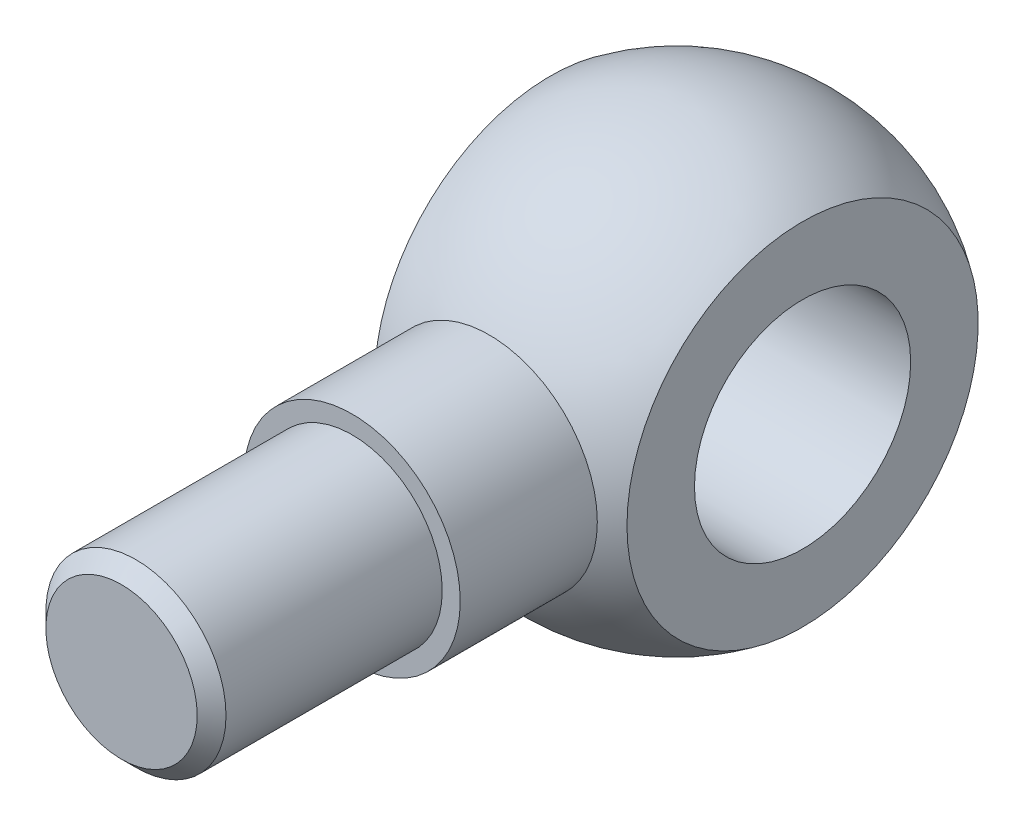
ISO-10303-21;
HEADER;
FILE_DESCRIPTION(('STEP AP214'),'2;1');
FILE_NAME('part.step','',(''),(''),'','','');
FILE_SCHEMA(('AUTOMOTIVE_DESIGN { 1 0 10303 214 1 1 1 1 }'));
ENDSEC;
DATA;
#1=APPLICATION_CONTEXT('core data for automotive mechanical design processes');
#2=APPLICATION_PROTOCOL_DEFINITION('international standard','automotive_design',2000,#1);
#3=PRODUCT_CONTEXT('',#1,'mechanical');
#4=PRODUCT('Part','Part','',(#3));
#5=PRODUCT_RELATED_PRODUCT_CATEGORY('part','',(#4));
#6=PRODUCT_DEFINITION_FORMATION('','',#4);
#7=PRODUCT_DEFINITION_CONTEXT('part definition',#1,'design');
#8=PRODUCT_DEFINITION('design','',#6,#7);
#9=PRODUCT_DEFINITION_SHAPE('','',#8);
#10=(LENGTH_UNIT() NAMED_UNIT(*) SI_UNIT(.MILLI.,.METRE.));
#11=(NAMED_UNIT(*) PLANE_ANGLE_UNIT() SI_UNIT($,.RADIAN.));
#12=(NAMED_UNIT(*) SI_UNIT($,.STERADIAN.) SOLID_ANGLE_UNIT());
#13=UNCERTAINTY_MEASURE_WITH_UNIT(LENGTH_MEASURE(1.E-05),#10,'distance_accuracy_value','');
#14=(GEOMETRIC_REPRESENTATION_CONTEXT(3) GLOBAL_UNCERTAINTY_ASSIGNED_CONTEXT((#13)) GLOBAL_UNIT_ASSIGNED_CONTEXT((#10,
#11,#12)) REPRESENTATION_CONTEXT('',''));
#15=CARTESIAN_POINT('',(0.,0.,0.));
#16=DIRECTION('',(0.,0.,1.));
#17=DIRECTION('',(1.,0.,0.));
#18=AXIS2_PLACEMENT_3D('',#15,#16,#17);
#19=CARTESIAN_POINT('',(17.5,0.,0.));
#20=DIRECTION('',(1.,0.,0.));
#21=DIRECTION('',(0.,0.,-1.));
#22=AXIS2_PLACEMENT_3D('',#19,#20,#21);
#23=PLANE('',#22);
#24=CARTESIAN_POINT('',(17.5,0.,0.));
#25=DIRECTION('',(-1.,0.,0.));
#26=DIRECTION('',(0.,0.,1.));
#27=AXIS2_PLACEMENT_3D('',#24,#25,#26);
#28=CIRCLE('',#27,15.);
#29=CARTESIAN_POINT('',(17.5,0.,15.));
#30=VERTEX_POINT('',#29);
#31=EDGE_CURVE('E60',#30,#30,#28,.T.);
#32=ORIENTED_EDGE('',*,*,#31,.T.);
#33=EDGE_LOOP('',(#32));
#34=FACE_BOUND('',#33,.T.);
#35=CARTESIAN_POINT('',(17.5,0.,0.));
#36=DIRECTION('',(-1.,0.,0.));
#37=DIRECTION('',(0.,0.,1.));
#38=AXIS2_PLACEMENT_3D('',#35,#36,#37);
#39=CIRCLE('',#38,24.3669858620224);
#40=CARTESIAN_POINT('',(17.5,0.,24.3669858620224));
#41=VERTEX_POINT('',#40);
#42=EDGE_CURVE('E49',#41,#41,#39,.T.);
#43=ORIENTED_EDGE('',*,*,#42,.F.);
#44=EDGE_LOOP('',(#43));
#45=FACE_BOUND('',#44,.T.);
#46=ADVANCED_FACE('F34',(#34,#45),#23,.T.);
#47=CARTESIAN_POINT('',(0.,0.,0.));
#48=DIRECTION('',(-1.,0.,0.));
#49=DIRECTION('',(0.,1.,0.));
#50=AXIS2_PLACEMENT_3D('',#47,#48,#49);
#51=SPHERICAL_SURFACE('',#50,30.);
#52=CARTESIAN_POINT('',(0.,0.,25.9807621135332));
#53=DIRECTION('',(0.,0.,-1.));
#54=DIRECTION('',(-1.,0.,0.));
#55=AXIS2_PLACEMENT_3D('',#52,#53,#54);
#56=CIRCLE('',#55,15.);
#57=CARTESIAN_POINT('',(-15.,0.,25.9807621135332));
#58=VERTEX_POINT('',#57);
#59=EDGE_CURVE('E66',#58,#58,#56,.F.);
#60=ORIENTED_EDGE('',*,*,#59,.F.);
#61=EDGE_LOOP('',(#60));
#62=FACE_BOUND('',#61,.T.);
#63=CARTESIAN_POINT('',(-17.5,0.,0.));
#64=DIRECTION('',(-1.,0.,0.));
#65=DIRECTION('',(0.,0.,1.));
#66=AXIS2_PLACEMENT_3D('',#63,#64,#65);
#67=CIRCLE('',#66,24.3669858620224);
#68=CARTESIAN_POINT('',(-17.5,0.,24.3669858620224));
#69=VERTEX_POINT('',#68);
#70=EDGE_CURVE('E54',#69,#69,#67,.T.);
#71=ORIENTED_EDGE('',*,*,#70,.F.);
#72=EDGE_LOOP('',(#71));
#73=FACE_BOUND('',#72,.T.);
#74=ORIENTED_EDGE('',*,*,#42,.T.);
#75=EDGE_LOOP('',(#74));
#76=FACE_BOUND('',#75,.T.);
#77=ADVANCED_FACE('F72',(#62,#73,#76),#51,.T.);
#78=CARTESIAN_POINT('',(-17.5,0.,0.));
#79=DIRECTION('',(1.,0.,0.));
#80=DIRECTION('',(0.,0.,-1.));
#81=AXIS2_PLACEMENT_3D('',#78,#79,#80);
#82=PLANE('',#81);
#83=CARTESIAN_POINT('',(-17.5,0.,0.));
#84=DIRECTION('',(-1.,0.,0.));
#85=DIRECTION('',(0.,0.,1.));
#86=AXIS2_PLACEMENT_3D('',#83,#84,#85);
#87=CIRCLE('',#86,15.);
#88=CARTESIAN_POINT('',(-17.5,0.,15.));
#89=VERTEX_POINT('',#88);
#90=EDGE_CURVE('E57',#89,#89,#87,.T.);
#91=ORIENTED_EDGE('',*,*,#90,.F.);
#92=EDGE_LOOP('',(#91));
#93=FACE_BOUND('',#92,.T.);
#94=ORIENTED_EDGE('',*,*,#70,.T.);
#95=EDGE_LOOP('',(#94));
#96=FACE_BOUND('',#95,.T.);
#97=ADVANCED_FACE('F75',(#93,#96),#82,.F.);
#98=CARTESIAN_POINT('',(-37.4733333333334,0.,0.));
#99=DIRECTION('',(-1.,0.,0.));
#100=DIRECTION('',(0.,0.,1.));
#101=AXIS2_PLACEMENT_3D('',#98,#99,#100);
#102=CYLINDRICAL_SURFACE('',#101,15.);
#103=ORIENTED_EDGE('',*,*,#31,.F.);
#104=EDGE_LOOP('',(#103));
#105=FACE_BOUND('',#104,.T.);
#106=ORIENTED_EDGE('',*,*,#90,.T.);
#107=EDGE_LOOP('',(#106));
#108=FACE_BOUND('',#107,.T.);
#109=ADVANCED_FACE('F88',(#105,#108),#102,.F.);
#110=CARTESIAN_POINT('',(0.,0.,-30.001));
#111=DIRECTION('',(0.,0.,1.));
#112=DIRECTION('',(1.,0.,0.));
#113=AXIS2_PLACEMENT_3D('',#110,#111,#112);
#114=CYLINDRICAL_SURFACE('',#113,15.);
#115=CARTESIAN_POINT('',(0.,0.,45.));
#116=DIRECTION('',(0.,0.,1.));
#117=DIRECTION('',(1.,0.,0.));
#118=AXIS2_PLACEMENT_3D('',#115,#116,#117);
#119=CIRCLE('',#118,15.);
#120=CARTESIAN_POINT('',(15.,0.,45.));
#121=VERTEX_POINT('',#120);
#122=EDGE_CURVE('E63',#121,#121,#119,.T.);
#123=ORIENTED_EDGE('',*,*,#122,.F.);
#124=EDGE_LOOP('',(#123));
#125=FACE_BOUND('',#124,.T.);
#126=ORIENTED_EDGE('',*,*,#59,.T.);
#127=EDGE_LOOP('',(#126));
#128=FACE_BOUND('',#127,.T.);
#129=ADVANCED_FACE('F70',(#125,#128),#114,.T.);
#130=CARTESIAN_POINT('',(0.,0.,45.));
#131=DIRECTION('',(0.,0.,1.));
#132=DIRECTION('',(1.,0.,0.));
#133=AXIS2_PLACEMENT_3D('',#130,#131,#132);
#134=PLANE('',#133);
#135=CARTESIAN_POINT('',(0.,0.,45.));
#136=DIRECTION('',(0.,0.,1.));
#137=DIRECTION('',(1.,0.,0.));
#138=AXIS2_PLACEMENT_3D('',#135,#136,#137);
#139=CIRCLE('',#138,12.5);
#140=CARTESIAN_POINT('',(12.5,0.,45.));
#141=VERTEX_POINT('',#140);
#142=EDGE_CURVE('E45',#141,#141,#139,.T.);
#143=ORIENTED_EDGE('',*,*,#142,.F.);
#144=EDGE_LOOP('',(#143));
#145=FACE_BOUND('',#144,.T.);
#146=ORIENTED_EDGE('',*,*,#122,.T.);
#147=EDGE_LOOP('',(#146));
#148=FACE_BOUND('',#147,.T.);
#149=ADVANCED_FACE('F95',(#145,#148),#134,.T.);
#150=CARTESIAN_POINT('',(0.,0.,77.));
#151=DIRECTION('',(0.,0.,-1.));
#152=DIRECTION('',(-1.,0.,0.));
#153=AXIS2_PLACEMENT_3D('',#150,#151,#152);
#154=CYLINDRICAL_SURFACE('',#153,12.5);
#155=CARTESIAN_POINT('',(0.,0.,75.));
#156=DIRECTION('',(0.,0.,1.));
#157=DIRECTION('',(1.,0.,0.));
#158=AXIS2_PLACEMENT_3D('',#155,#156,#157);
#159=CIRCLE('',#158,12.5);
#160=CARTESIAN_POINT('',(12.5,0.,75.));
#161=VERTEX_POINT('',#160);
#162=EDGE_CURVE('E10',#161,#161,#159,.F.);
#163=ORIENTED_EDGE('',*,*,#162,.T.);
#164=EDGE_LOOP('',(#163));
#165=FACE_BOUND('',#164,.T.);
#166=ORIENTED_EDGE('',*,*,#142,.T.);
#167=EDGE_LOOP('',(#166));
#168=FACE_BOUND('',#167,.T.);
#169=ADVANCED_FACE('F99',(#165,#168),#154,.T.);
#170=CARTESIAN_POINT('',(0.,0.,77.));
#171=DIRECTION('',(0.,0.,1.));
#172=DIRECTION('',(1.,0.,0.));
#173=AXIS2_PLACEMENT_3D('',#170,#171,#172);
#174=PLANE('',#173);
#175=CARTESIAN_POINT('',(0.,0.,77.));
#176=DIRECTION('',(0.,0.,1.));
#177=DIRECTION('',(1.,0.,0.));
#178=AXIS2_PLACEMENT_3D('',#175,#176,#177);
#179=CIRCLE('',#178,10.5);
#180=CARTESIAN_POINT('',(10.5,0.,77.));
#181=VERTEX_POINT('',#180);
#182=EDGE_CURVE('E41',#181,#181,#179,.T.);
#183=ORIENTED_EDGE('',*,*,#182,.T.);
#184=EDGE_LOOP('',(#183));
#185=FACE_BOUND('',#184,.T.);
#186=ADVANCED_FACE('F103',(#185),#174,.T.);
#187=CARTESIAN_POINT('',(0.,0.,77.));
#188=DIRECTION('',(0.,0.,-1.));
#189=DIRECTION('',(-1.,0.,0.));
#190=AXIS2_PLACEMENT_3D('',#187,#188,#189);
#191=CONICAL_SURFACE('',#190,10.5,0.785398163397449);
#192=ORIENTED_EDGE('',*,*,#162,.F.);
#193=EDGE_LOOP('',(#192));
#194=FACE_BOUND('',#193,.T.);
#195=ORIENTED_EDGE('',*,*,#182,.F.);
#196=EDGE_LOOP('',(#195));
#197=FACE_BOUND('',#196,.T.);
#198=ADVANCED_FACE('F36',(#194,#197),#191,.T.);
#199=CLOSED_SHELL('',(#46,#77,#97,#109,#129,#149,#169,#186,#198));
#200=MANIFOLD_SOLID_BREP('B2',#199);
#201=ADVANCED_BREP_SHAPE_REPRESENTATION('',(#18,#200),#14);
#202=SHAPE_DEFINITION_REPRESENTATION(#9,#201);
ENDSEC;
END-ISO-10303-21;
